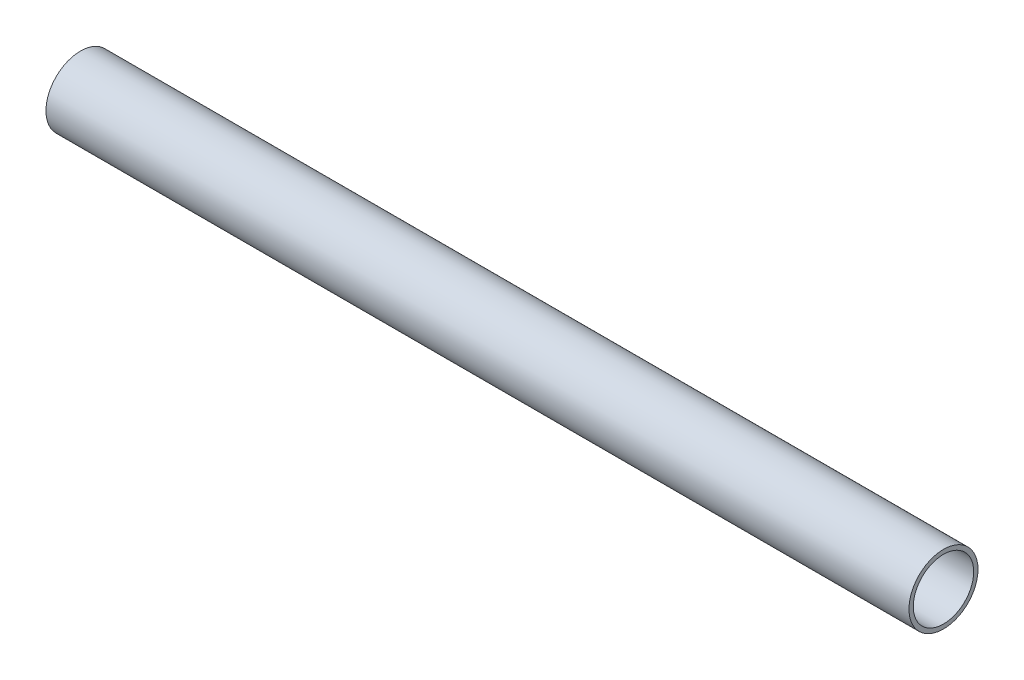
ISO-10303-21;
HEADER;
FILE_DESCRIPTION(('STEP AP214'),'2;1');
FILE_NAME('part.step','',(''),(''),'','','');
FILE_SCHEMA(('AUTOMOTIVE_DESIGN { 1 0 10303 214 1 1 1 1 }'));
ENDSEC;
DATA;
#1=APPLICATION_CONTEXT('core data for automotive mechanical design processes');
#2=APPLICATION_PROTOCOL_DEFINITION('international standard','automotive_design',2000,#1);
#3=PRODUCT_CONTEXT('',#1,'mechanical');
#4=PRODUCT('Part','Part','',(#3));
#5=PRODUCT_RELATED_PRODUCT_CATEGORY('part','',(#4));
#6=PRODUCT_DEFINITION_FORMATION('','',#4);
#7=PRODUCT_DEFINITION_CONTEXT('part definition',#1,'design');
#8=PRODUCT_DEFINITION('design','',#6,#7);
#9=PRODUCT_DEFINITION_SHAPE('','',#8);
#10=(LENGTH_UNIT() NAMED_UNIT(*) SI_UNIT(.MILLI.,.METRE.));
#11=(NAMED_UNIT(*) PLANE_ANGLE_UNIT() SI_UNIT($,.RADIAN.));
#12=(NAMED_UNIT(*) SI_UNIT($,.STERADIAN.) SOLID_ANGLE_UNIT());
#13=UNCERTAINTY_MEASURE_WITH_UNIT(LENGTH_MEASURE(1.E-05),#10,'distance_accuracy_value','');
#14=(GEOMETRIC_REPRESENTATION_CONTEXT(3) GLOBAL_UNCERTAINTY_ASSIGNED_CONTEXT((#13)) GLOBAL_UNIT_ASSIGNED_CONTEXT((#10,
#11,#12)) REPRESENTATION_CONTEXT('',''));
#15=CARTESIAN_POINT('',(0.,0.,0.));
#16=DIRECTION('',(0.,0.,1.));
#17=DIRECTION('',(1.,0.,0.));
#18=AXIS2_PLACEMENT_3D('',#15,#16,#17);
#19=CARTESIAN_POINT('',(500.,0.,0.));
#20=DIRECTION('',(1.,0.,0.));
#21=DIRECTION('',(0.,0.,-1.));
#22=AXIS2_PLACEMENT_3D('',#19,#20,#21);
#23=PLANE('',#22);
#24=CARTESIAN_POINT('',(500.,0.,0.));
#25=DIRECTION('',(1.,0.,0.));
#26=DIRECTION('',(0.,0.,-1.));
#27=AXIS2_PLACEMENT_3D('',#24,#25,#26);
#28=CIRCLE('',#27,20.);
#29=CARTESIAN_POINT('',(500.,0.,-20.));
#30=VERTEX_POINT('',#29);
#31=EDGE_CURVE('E10',#30,#30,#28,.T.);
#32=ORIENTED_EDGE('',*,*,#31,.T.);
#33=EDGE_LOOP('',(#32));
#34=FACE_BOUND('',#33,.T.);
#35=CARTESIAN_POINT('',(500.,0.,0.));
#36=DIRECTION('',(1.,0.,0.));
#37=DIRECTION('',(0.,0.,-1.));
#38=AXIS2_PLACEMENT_3D('',#35,#36,#37);
#39=CIRCLE('',#38,17.5);
#40=CARTESIAN_POINT('',(500.,0.,-17.5));
#41=VERTEX_POINT('',#40);
#42=EDGE_CURVE('E45',#41,#41,#39,.T.);
#43=ORIENTED_EDGE('',*,*,#42,.F.);
#44=EDGE_LOOP('',(#43));
#45=FACE_BOUND('',#44,.T.);
#46=ADVANCED_FACE('F34',(#34,#45),#23,.T.);
#47=CARTESIAN_POINT('',(0.,0.,0.));
#48=DIRECTION('',(1.,0.,0.));
#49=DIRECTION('',(0.,0.,-1.));
#50=AXIS2_PLACEMENT_3D('',#47,#48,#49);
#51=PLANE('',#50);
#52=CARTESIAN_POINT('',(0.,0.,0.));
#53=DIRECTION('',(1.,0.,0.));
#54=DIRECTION('',(0.,0.,-1.));
#55=AXIS2_PLACEMENT_3D('',#52,#53,#54);
#56=CIRCLE('',#55,20.);
#57=CARTESIAN_POINT('',(0.,0.,-20.));
#58=VERTEX_POINT('',#57);
#59=EDGE_CURVE('E38',#58,#58,#56,.T.);
#60=ORIENTED_EDGE('',*,*,#59,.F.);
#61=EDGE_LOOP('',(#60));
#62=FACE_BOUND('',#61,.T.);
#63=CARTESIAN_POINT('',(0.,0.,0.));
#64=DIRECTION('',(1.,0.,0.));
#65=DIRECTION('',(0.,0.,-1.));
#66=AXIS2_PLACEMENT_3D('',#63,#64,#65);
#67=CIRCLE('',#66,17.5);
#68=CARTESIAN_POINT('',(0.,0.,-17.5));
#69=VERTEX_POINT('',#68);
#70=EDGE_CURVE('E47',#69,#69,#67,.T.);
#71=ORIENTED_EDGE('',*,*,#70,.T.);
#72=EDGE_LOOP('',(#71));
#73=FACE_BOUND('',#72,.T.);
#74=ADVANCED_FACE('F57',(#62,#73),#51,.F.);
#75=CARTESIAN_POINT('',(500.,0.,0.));
#76=DIRECTION('',(-1.,0.,0.));
#77=DIRECTION('',(0.,0.,1.));
#78=AXIS2_PLACEMENT_3D('',#75,#76,#77);
#79=CYLINDRICAL_SURFACE('',#78,20.);
#80=ORIENTED_EDGE('',*,*,#31,.F.);
#81=EDGE_LOOP('',(#80));
#82=FACE_BOUND('',#81,.T.);
#83=ORIENTED_EDGE('',*,*,#59,.T.);
#84=EDGE_LOOP('',(#83));
#85=FACE_BOUND('',#84,.T.);
#86=ADVANCED_FACE('F36',(#82,#85),#79,.T.);
#87=CARTESIAN_POINT('',(500.,0.,0.));
#88=DIRECTION('',(-1.,0.,0.));
#89=DIRECTION('',(0.,0.,1.));
#90=AXIS2_PLACEMENT_3D('',#87,#88,#89);
#91=CYLINDRICAL_SURFACE('',#90,17.5);
#92=ORIENTED_EDGE('',*,*,#42,.T.);
#93=EDGE_LOOP('',(#92));
#94=FACE_BOUND('',#93,.T.);
#95=ORIENTED_EDGE('',*,*,#70,.F.);
#96=EDGE_LOOP('',(#95));
#97=FACE_BOUND('',#96,.T.);
#98=ADVANCED_FACE('F53',(#94,#97),#91,.F.);
#99=CLOSED_SHELL('',(#46,#74,#86,#98));
#100=MANIFOLD_SOLID_BREP('B2',#99);
#101=ADVANCED_BREP_SHAPE_REPRESENTATION('',(#18,#100),#14);
#102=SHAPE_DEFINITION_REPRESENTATION(#9,#101);
ENDSEC;
END-ISO-10303-21;
